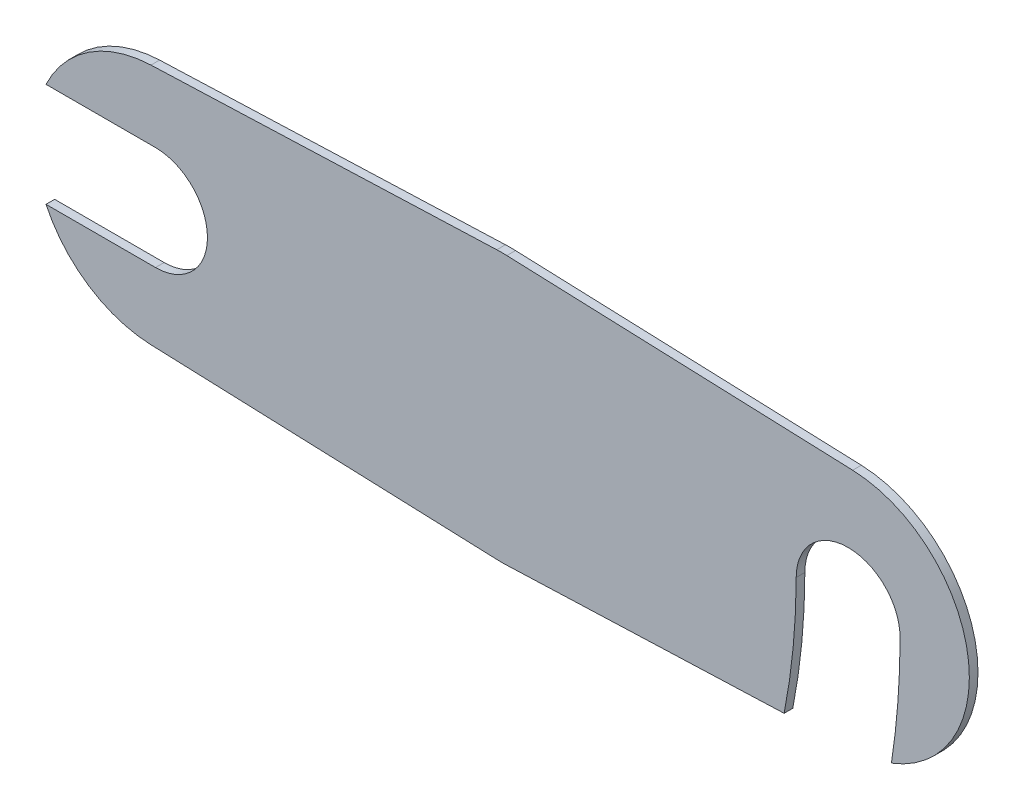
ISO-10303-21;
HEADER;
FILE_DESCRIPTION(('STEP AP214'),'2;1');
FILE_NAME('part.step','',(''),(''),'','','');
FILE_SCHEMA(('AUTOMOTIVE_DESIGN { 1 0 10303 214 1 1 1 1 }'));
ENDSEC;
DATA;
#1=APPLICATION_CONTEXT('core data for automotive mechanical design processes');
#2=APPLICATION_PROTOCOL_DEFINITION('international standard','automotive_design',2000,#1);
#3=PRODUCT_CONTEXT('',#1,'mechanical');
#4=PRODUCT('Part','Part','',(#3));
#5=PRODUCT_RELATED_PRODUCT_CATEGORY('part','',(#4));
#6=PRODUCT_DEFINITION_FORMATION('','',#4);
#7=PRODUCT_DEFINITION_CONTEXT('part definition',#1,'design');
#8=PRODUCT_DEFINITION('design','',#6,#7);
#9=PRODUCT_DEFINITION_SHAPE('','',#8);
#10=(LENGTH_UNIT() NAMED_UNIT(*) SI_UNIT(.MILLI.,.METRE.));
#11=(NAMED_UNIT(*) PLANE_ANGLE_UNIT() SI_UNIT($,.RADIAN.));
#12=(NAMED_UNIT(*) SI_UNIT($,.STERADIAN.) SOLID_ANGLE_UNIT());
#13=UNCERTAINTY_MEASURE_WITH_UNIT(LENGTH_MEASURE(1.E-05),#10,'distance_accuracy_value','');
#14=(GEOMETRIC_REPRESENTATION_CONTEXT(3) GLOBAL_UNCERTAINTY_ASSIGNED_CONTEXT((#13)) GLOBAL_UNIT_ASSIGNED_CONTEXT((#10,
#11,#12)) REPRESENTATION_CONTEXT('',''));
#15=CARTESIAN_POINT('',(0.,0.,0.));
#16=DIRECTION('',(0.,0.,1.));
#17=DIRECTION('',(1.,0.,0.));
#18=AXIS2_PLACEMENT_3D('',#15,#16,#17);
#19=CARTESIAN_POINT('',(0.,0.,-0.5));
#20=DIRECTION('',(0.,0.,-1.));
#21=DIRECTION('',(1.,0.,0.));
#22=AXIS2_PLACEMENT_3D('',#19,#20,#21);
#23=PLANE('',#22);
#24=CARTESIAN_POINT('',(20.,0.,-0.5));
#25=DIRECTION('',(0.,0.,1.));
#26=DIRECTION('',(1.,0.,0.));
#27=AXIS2_PLACEMENT_3D('',#24,#25,#26);
#28=CIRCLE('',#27,3.);
#29=CARTESIAN_POINT('',(23.,0.,-0.5));
#30=VERTEX_POINT('',#29);
#31=CARTESIAN_POINT('',(17.,0.,-0.5));
#32=VERTEX_POINT('',#31);
#33=EDGE_CURVE('E149',#30,#32,#28,.T.);
#34=ORIENTED_EDGE('',*,*,#33,.T.);
#35=CARTESIAN_POINT('',(-20.,0.,-0.5));
#36=DIRECTION('',(0.,0.,1.));
#37=DIRECTION('',(1.,0.,0.));
#38=AXIS2_PLACEMENT_3D('',#35,#36,#37);
#39=CIRCLE('',#38,37.);
#40=CARTESIAN_POINT('',(16.3038364291376,-7.14363076638377,-0.5));
#41=VERTEX_POINT('',#40);
#42=EDGE_CURVE('E163',#32,#41,#39,.F.);
#43=ORIENTED_EDGE('',*,*,#42,.T.);
#44=DIRECTION('',(0.999296627633657,0.0375000000000003,0.));
#45=VECTOR('',#44,1.);
#46=CARTESIAN_POINT('',(0.290625000000002,-7.74454886416084,-0.5));
#47=LINE('',#46,#45);
#48=CARTESIAN_POINT('',(0.290625000000003,-7.74454886416084,-0.5));
#49=VERTEX_POINT('',#48);
#50=EDGE_CURVE('E219',#49,#41,#47,.T.);
#51=ORIENTED_EDGE('',*,*,#50,.F.);
#52=CARTESIAN_POINT('',(0.,0.,-0.5));
#53=DIRECTION('',(0.,0.,1.));
#54=DIRECTION('',(1.,0.,0.));
#55=AXIS2_PLACEMENT_3D('',#52,#53,#54);
#56=CIRCLE('',#55,7.75);
#57=CARTESIAN_POINT('',(-0.290625,-7.74454886416085,-0.5));
#58=VERTEX_POINT('',#57);
#59=EDGE_CURVE('E216',#58,#49,#56,.T.);
#60=ORIENTED_EDGE('',*,*,#59,.F.);
#61=DIRECTION('',(0.999296627633657,-0.0375,0.));
#62=VECTOR('',#61,1.);
#63=CARTESIAN_POINT('',(-0.290625,-7.74454886416085,-0.5));
#64=LINE('',#63,#62);
#65=CARTESIAN_POINT('',(-20.2625,-6.9950763934356,-0.5));
#66=VERTEX_POINT('',#65);
#67=EDGE_CURVE('E213',#66,#58,#64,.T.);
#68=ORIENTED_EDGE('',*,*,#67,.F.);
#69=CARTESIAN_POINT('',(-20.,0.,-0.5));
#70=DIRECTION('',(0.,0.,1.));
#71=DIRECTION('',(1.,0.,0.));
#72=AXIS2_PLACEMENT_3D('',#69,#70,#71);
#73=CIRCLE('',#72,7.);
#74=CARTESIAN_POINT('',(-26.3245553203368,-3.,-0.5));
#75=VERTEX_POINT('',#74);
#76=EDGE_CURVE('E209',#75,#66,#73,.T.);
#77=ORIENTED_EDGE('',*,*,#76,.F.);
#78=DIRECTION('',(1.,0.,0.));
#79=VECTOR('',#78,1.);
#80=CARTESIAN_POINT('',(-20.,-3.,-0.5));
#81=LINE('',#80,#79);
#82=CARTESIAN_POINT('',(-20.,-3.,-0.5));
#83=VERTEX_POINT('',#82);
#84=EDGE_CURVE('E180',#75,#83,#81,.T.);
#85=ORIENTED_EDGE('',*,*,#84,.T.);
#86=CARTESIAN_POINT('',(-20.,0.,-0.5));
#87=DIRECTION('',(0.,0.,1.));
#88=DIRECTION('',(1.,0.,0.));
#89=AXIS2_PLACEMENT_3D('',#86,#87,#88);
#90=CIRCLE('',#89,3.);
#91=CARTESIAN_POINT('',(-20.,3.,-0.5));
#92=VERTEX_POINT('',#91);
#93=EDGE_CURVE('E196',#83,#92,#90,.T.);
#94=ORIENTED_EDGE('',*,*,#93,.T.);
#95=DIRECTION('',(-1.,0.,0.));
#96=VECTOR('',#95,1.);
#97=CARTESIAN_POINT('',(-20.,3.,-0.5));
#98=LINE('',#97,#96);
#99=CARTESIAN_POINT('',(-26.3245553203368,3.,-0.5));
#100=VERTEX_POINT('',#99);
#101=EDGE_CURVE('E172',#92,#100,#98,.T.);
#102=ORIENTED_EDGE('',*,*,#101,.T.);
#103=CARTESIAN_POINT('',(-20.2625,6.9950763934356,-0.5));
#104=VERTEX_POINT('',#103);
#105=EDGE_CURVE('E210',#104,#100,#73,.T.);
#106=ORIENTED_EDGE('',*,*,#105,.F.);
#107=DIRECTION('',(-0.999296627633657,-0.0375,0.));
#108=VECTOR('',#107,1.);
#109=CARTESIAN_POINT('',(-0.290625,7.74454886416085,-0.5));
#110=LINE('',#109,#108);
#111=CARTESIAN_POINT('',(-0.290625,7.74454886416085,-0.5));
#112=VERTEX_POINT('',#111);
#113=EDGE_CURVE('E205',#112,#104,#110,.T.);
#114=ORIENTED_EDGE('',*,*,#113,.F.);
#115=CARTESIAN_POINT('',(0.,0.,-0.5));
#116=DIRECTION('',(0.,0.,1.));
#117=DIRECTION('',(1.,0.,0.));
#118=AXIS2_PLACEMENT_3D('',#115,#116,#117);
#119=CIRCLE('',#118,7.75);
#120=CARTESIAN_POINT('',(0.290624999999998,7.74454886416084,-0.5));
#121=VERTEX_POINT('',#120);
#122=EDGE_CURVE('E202',#121,#112,#119,.T.);
#123=ORIENTED_EDGE('',*,*,#122,.F.);
#124=DIRECTION('',(-0.999296627633657,0.0374999999999998,0.));
#125=VECTOR('',#124,1.);
#126=CARTESIAN_POINT('',(0.290624999999998,7.74454886416084,-0.5));
#127=LINE('',#126,#125);
#128=CARTESIAN_POINT('',(20.2625,6.99507639343561,-0.5));
#129=VERTEX_POINT('',#128);
#130=EDGE_CURVE('E225',#129,#121,#127,.T.);
#131=ORIENTED_EDGE('',*,*,#130,.F.);
#132=CARTESIAN_POINT('',(20.,0.,-0.5));
#133=DIRECTION('',(0.,0.,1.));
#134=DIRECTION('',(1.,0.,0.));
#135=AXIS2_PLACEMENT_3D('',#132,#133,#134);
#136=CIRCLE('',#135,7.);
#137=CARTESIAN_POINT('',(22.5,-6.53834841531101,-0.5));
#138=VERTEX_POINT('',#137);
#139=EDGE_CURVE('E222',#138,#129,#136,.T.);
#140=ORIENTED_EDGE('',*,*,#139,.F.);
#141=CARTESIAN_POINT('',(-20.,0.,-0.5));
#142=DIRECTION('',(0.,0.,1.));
#143=DIRECTION('',(1.,0.,0.));
#144=AXIS2_PLACEMENT_3D('',#141,#142,#143);
#145=CIRCLE('',#144,43.);
#146=EDGE_CURVE('E167',#30,#138,#145,.F.);
#147=ORIENTED_EDGE('',*,*,#146,.F.);
#148=EDGE_LOOP('',(#34,#43,#51,#60,#68,#77,#85,#94,#102,#106,#114,#123,#131,#140,#147));
#149=FACE_BOUND('',#148,.T.);
#150=ADVANCED_FACE('F37',(#149),#23,.T.);
#151=CARTESIAN_POINT('',(0.,0.,0.));
#152=DIRECTION('',(0.,0.,-1.));
#153=DIRECTION('',(1.,0.,0.));
#154=AXIS2_PLACEMENT_3D('',#151,#152,#153);
#155=PLANE('',#154);
#156=CARTESIAN_POINT('',(-20.,0.,0.));
#157=DIRECTION('',(0.,0.,1.));
#158=DIRECTION('',(1.,0.,0.));
#159=AXIS2_PLACEMENT_3D('',#156,#157,#158);
#160=CIRCLE('',#159,43.);
#161=CARTESIAN_POINT('',(23.,0.,0.));
#162=VERTEX_POINT('',#161);
#163=CARTESIAN_POINT('',(22.5,-6.53834841531101,0.));
#164=VERTEX_POINT('',#163);
#165=EDGE_CURVE('E156',#162,#164,#160,.F.);
#166=ORIENTED_EDGE('',*,*,#165,.T.);
#167=CARTESIAN_POINT('',(20.,0.,0.));
#168=DIRECTION('',(0.,0.,1.));
#169=DIRECTION('',(1.,0.,0.));
#170=AXIS2_PLACEMENT_3D('',#167,#168,#169);
#171=CIRCLE('',#170,7.);
#172=CARTESIAN_POINT('',(20.2625,6.99507639343561,0.));
#173=VERTEX_POINT('',#172);
#174=EDGE_CURVE('E246',#164,#173,#171,.T.);
#175=ORIENTED_EDGE('',*,*,#174,.T.);
#176=DIRECTION('',(-0.999296627633657,0.0374999999999998,0.));
#177=VECTOR('',#176,1.);
#178=CARTESIAN_POINT('',(0.290624999999998,7.74454886416084,0.));
#179=LINE('',#178,#177);
#180=CARTESIAN_POINT('',(0.290624999999998,7.74454886416084,0.));
#181=VERTEX_POINT('',#180);
#182=EDGE_CURVE('E206',#173,#181,#179,.T.);
#183=ORIENTED_EDGE('',*,*,#182,.T.);
#184=CARTESIAN_POINT('',(0.,0.,0.));
#185=DIRECTION('',(0.,0.,1.));
#186=DIRECTION('',(1.,0.,0.));
#187=AXIS2_PLACEMENT_3D('',#184,#185,#186);
#188=CIRCLE('',#187,7.75);
#189=CARTESIAN_POINT('',(-0.290625,7.74454886416085,0.));
#190=VERTEX_POINT('',#189);
#191=EDGE_CURVE('E199',#181,#190,#188,.T.);
#192=ORIENTED_EDGE('',*,*,#191,.T.);
#193=DIRECTION('',(-0.999296627633657,-0.0375,0.));
#194=VECTOR('',#193,1.);
#195=CARTESIAN_POINT('',(-0.290625,7.74454886416085,0.));
#196=LINE('',#195,#194);
#197=CARTESIAN_POINT('',(-20.2625,6.9950763934356,0.));
#198=VERTEX_POINT('',#197);
#199=EDGE_CURVE('E231',#190,#198,#196,.T.);
#200=ORIENTED_EDGE('',*,*,#199,.T.);
#201=CARTESIAN_POINT('',(-20.,0.,0.));
#202=DIRECTION('',(0.,0.,1.));
#203=DIRECTION('',(1.,0.,0.));
#204=AXIS2_PLACEMENT_3D('',#201,#202,#203);
#205=CIRCLE('',#204,7.);
#206=CARTESIAN_POINT('',(-26.3245553203368,3.,0.));
#207=VERTEX_POINT('',#206);
#208=EDGE_CURVE('E235',#198,#207,#205,.T.);
#209=ORIENTED_EDGE('',*,*,#208,.T.);
#210=DIRECTION('',(-1.,0.,0.));
#211=VECTOR('',#210,1.);
#212=CARTESIAN_POINT('',(-20.,3.,0.));
#213=LINE('',#212,#211);
#214=CARTESIAN_POINT('',(-20.,3.,0.));
#215=VERTEX_POINT('',#214);
#216=EDGE_CURVE('E176',#215,#207,#213,.T.);
#217=ORIENTED_EDGE('',*,*,#216,.F.);
#218=CARTESIAN_POINT('',(-20.,0.,0.));
#219=DIRECTION('',(0.,0.,1.));
#220=DIRECTION('',(1.,0.,0.));
#221=AXIS2_PLACEMENT_3D('',#218,#219,#220);
#222=CIRCLE('',#221,3.);
#223=CARTESIAN_POINT('',(-20.,-3.,0.));
#224=VERTEX_POINT('',#223);
#225=EDGE_CURVE('E194',#224,#215,#222,.T.);
#226=ORIENTED_EDGE('',*,*,#225,.F.);
#227=DIRECTION('',(1.,0.,0.));
#228=VECTOR('',#227,1.);
#229=CARTESIAN_POINT('',(-20.,-3.,0.));
#230=LINE('',#229,#228);
#231=CARTESIAN_POINT('',(-26.3245553203368,-3.,0.));
#232=VERTEX_POINT('',#231);
#233=EDGE_CURVE('E179',#232,#224,#230,.T.);
#234=ORIENTED_EDGE('',*,*,#233,.F.);
#235=CARTESIAN_POINT('',(-20.2625,-6.9950763934356,0.));
#236=VERTEX_POINT('',#235);
#237=EDGE_CURVE('E234',#232,#236,#205,.T.);
#238=ORIENTED_EDGE('',*,*,#237,.T.);
#239=DIRECTION('',(0.999296627633657,-0.0375,0.));
#240=VECTOR('',#239,1.);
#241=CARTESIAN_POINT('',(-0.290625,-7.74454886416085,0.));
#242=LINE('',#241,#240);
#243=CARTESIAN_POINT('',(-0.290625,-7.74454886416085,0.));
#244=VERTEX_POINT('',#243);
#245=EDGE_CURVE('E238',#236,#244,#242,.T.);
#246=ORIENTED_EDGE('',*,*,#245,.T.);
#247=CARTESIAN_POINT('',(0.,0.,0.));
#248=DIRECTION('',(0.,0.,1.));
#249=DIRECTION('',(1.,0.,0.));
#250=AXIS2_PLACEMENT_3D('',#247,#248,#249);
#251=CIRCLE('',#250,7.75);
#252=CARTESIAN_POINT('',(0.290625000000003,-7.74454886416084,0.));
#253=VERTEX_POINT('',#252);
#254=EDGE_CURVE('E241',#244,#253,#251,.T.);
#255=ORIENTED_EDGE('',*,*,#254,.T.);
#256=DIRECTION('',(0.999296627633657,0.0375000000000003,0.));
#257=VECTOR('',#256,1.);
#258=CARTESIAN_POINT('',(0.290625000000002,-7.74454886416084,0.));
#259=LINE('',#258,#257);
#260=CARTESIAN_POINT('',(16.3038364291376,-7.14363076638377,0.));
#261=VERTEX_POINT('',#260);
#262=EDGE_CURVE('E244',#253,#261,#259,.T.);
#263=ORIENTED_EDGE('',*,*,#262,.T.);
#264=CARTESIAN_POINT('',(-20.,0.,0.));
#265=DIRECTION('',(0.,0.,1.));
#266=DIRECTION('',(1.,0.,0.));
#267=AXIS2_PLACEMENT_3D('',#264,#265,#266);
#268=CIRCLE('',#267,37.);
#269=CARTESIAN_POINT('',(17.,0.,0.));
#270=VERTEX_POINT('',#269);
#271=EDGE_CURVE('E150',#270,#261,#268,.F.);
#272=ORIENTED_EDGE('',*,*,#271,.F.);
#273=CARTESIAN_POINT('',(20.,0.,0.));
#274=DIRECTION('',(0.,0.,1.));
#275=DIRECTION('',(1.,0.,0.));
#276=AXIS2_PLACEMENT_3D('',#273,#274,#275);
#277=CIRCLE('',#276,3.);
#278=EDGE_CURVE('E146',#162,#270,#277,.T.);
#279=ORIENTED_EDGE('',*,*,#278,.F.);
#280=EDGE_LOOP('',(#166,#175,#183,#192,#200,#209,#217,#226,#234,#238,#246,#255,#263,#272,#279));
#281=FACE_BOUND('',#280,.T.);
#282=ADVANCED_FACE('F154',(#281),#155,.F.);
#283=CARTESIAN_POINT('',(20.,0.,-0.5));
#284=DIRECTION('',(0.,0.,1.));
#285=DIRECTION('',(-1.,0.,0.));
#286=AXIS2_PLACEMENT_3D('',#283,#284,#285);
#287=CYLINDRICAL_SURFACE('',#286,7.);
#288=DIRECTION('',(0.,0.,-1.));
#289=VECTOR('',#288,1.);
#290=CARTESIAN_POINT('',(22.5,-6.53834841531101,0.));
#291=LINE('',#290,#289);
#292=EDGE_CURVE('E161',#164,#138,#291,.T.);
#293=ORIENTED_EDGE('',*,*,#292,.T.);
#294=ORIENTED_EDGE('',*,*,#139,.T.);
#295=DIRECTION('',(0.,0.,1.));
#296=VECTOR('',#295,1.);
#297=CARTESIAN_POINT('',(20.2625,6.99507639343561,-0.5));
#298=LINE('',#297,#296);
#299=EDGE_CURVE('E251',#129,#173,#298,.T.);
#300=ORIENTED_EDGE('',*,*,#299,.T.);
#301=ORIENTED_EDGE('',*,*,#174,.F.);
#302=EDGE_LOOP('',(#293,#294,#300,#301));
#303=FACE_BOUND('',#302,.T.);
#304=ADVANCED_FACE('F316',(#303),#287,.T.);
#305=CARTESIAN_POINT('',(20.,0.,-0.5));
#306=DIRECTION('',(0.,0.,1.));
#307=DIRECTION('',(-1.,0.,0.));
#308=AXIS2_PLACEMENT_3D('',#305,#306,#307);
#309=CYLINDRICAL_SURFACE('',#308,3.);
#310=ORIENTED_EDGE('',*,*,#278,.T.);
#311=DIRECTION('',(0.,0.,-1.));
#312=VECTOR('',#311,1.);
#313=CARTESIAN_POINT('',(17.,0.,0.));
#314=LINE('',#313,#312);
#315=EDGE_CURVE('E52',#270,#32,#314,.T.);
#316=ORIENTED_EDGE('',*,*,#315,.T.);
#317=ORIENTED_EDGE('',*,*,#33,.F.);
#318=DIRECTION('',(0.,0.,-1.));
#319=VECTOR('',#318,1.);
#320=CARTESIAN_POINT('',(23.,0.,0.));
#321=LINE('',#320,#319);
#322=EDGE_CURVE('E60',#162,#30,#321,.T.);
#323=ORIENTED_EDGE('',*,*,#322,.F.);
#324=EDGE_LOOP('',(#310,#316,#317,#323));
#325=FACE_BOUND('',#324,.T.);
#326=ADVANCED_FACE('F145',(#325),#309,.F.);
#327=CARTESIAN_POINT('',(-20.,0.,-0.5));
#328=DIRECTION('',(0.,0.,1.));
#329=DIRECTION('',(-1.,0.,0.));
#330=AXIS2_PLACEMENT_3D('',#327,#328,#329);
#331=CYLINDRICAL_SURFACE('',#330,7.);
#332=ORIENTED_EDGE('',*,*,#76,.T.);
#333=DIRECTION('',(0.,0.,1.));
#334=VECTOR('',#333,1.);
#335=CARTESIAN_POINT('',(-20.2625,-6.9950763934356,-0.5));
#336=LINE('',#335,#334);
#337=EDGE_CURVE('E257',#66,#236,#336,.T.);
#338=ORIENTED_EDGE('',*,*,#337,.T.);
#339=ORIENTED_EDGE('',*,*,#237,.F.);
#340=DIRECTION('',(0.,0.,-1.));
#341=VECTOR('',#340,1.);
#342=CARTESIAN_POINT('',(-26.3245553203368,-3.,0.));
#343=LINE('',#342,#341);
#344=EDGE_CURVE('E189',#232,#75,#343,.T.);
#345=ORIENTED_EDGE('',*,*,#344,.T.);
#346=EDGE_LOOP('',(#332,#338,#339,#345));
#347=FACE_BOUND('',#346,.T.);
#348=ADVANCED_FACE('F289',(#347),#331,.T.);
#349=CARTESIAN_POINT('',(0.,0.,-0.5));
#350=DIRECTION('',(0.,0.,1.));
#351=DIRECTION('',(-1.,0.,0.));
#352=AXIS2_PLACEMENT_3D('',#349,#350,#351);
#353=CYLINDRICAL_SURFACE('',#352,7.75);
#354=ORIENTED_EDGE('',*,*,#191,.F.);
#355=DIRECTION('',(0.,0.,1.));
#356=VECTOR('',#355,1.);
#357=CARTESIAN_POINT('',(0.290624999999998,7.74454886416084,-0.5));
#358=LINE('',#357,#356);
#359=EDGE_CURVE('E228',#121,#181,#358,.T.);
#360=ORIENTED_EDGE('',*,*,#359,.F.);
#361=ORIENTED_EDGE('',*,*,#122,.T.);
#362=DIRECTION('',(0.,0.,1.));
#363=VECTOR('',#362,1.);
#364=CARTESIAN_POINT('',(-0.290625,7.74454886416085,-0.5));
#365=LINE('',#364,#363);
#366=EDGE_CURVE('E11',#112,#190,#365,.T.);
#367=ORIENTED_EDGE('',*,*,#366,.T.);
#368=EDGE_LOOP('',(#354,#360,#361,#367));
#369=FACE_BOUND('',#368,.T.);
#370=ADVANCED_FACE('F39',(#369),#353,.T.);
#371=CARTESIAN_POINT('',(-0.290625,7.74454886416085,-0.5));
#372=DIRECTION('',(0.0375,-0.999296627633657,0.));
#373=DIRECTION('',(0.999296627633657,0.0375,0.));
#374=AXIS2_PLACEMENT_3D('',#371,#372,#373);
#375=PLANE('',#374);
#376=ORIENTED_EDGE('',*,*,#199,.F.);
#377=ORIENTED_EDGE('',*,*,#366,.F.);
#378=ORIENTED_EDGE('',*,*,#113,.T.);
#379=DIRECTION('',(0.,0.,1.));
#380=VECTOR('',#379,1.);
#381=CARTESIAN_POINT('',(-20.2625,6.9950763934356,-0.5));
#382=LINE('',#381,#380);
#383=EDGE_CURVE('E45',#104,#198,#382,.T.);
#384=ORIENTED_EDGE('',*,*,#383,.T.);
#385=EDGE_LOOP('',(#376,#377,#378,#384));
#386=FACE_BOUND('',#385,.T.);
#387=ADVANCED_FACE('F261',(#386),#375,.F.);
#388=ORIENTED_EDGE('',*,*,#208,.F.);
#389=ORIENTED_EDGE('',*,*,#383,.F.);
#390=ORIENTED_EDGE('',*,*,#105,.T.);
#391=DIRECTION('',(0.,0.,-1.));
#392=VECTOR('',#391,1.);
#393=CARTESIAN_POINT('',(-26.3245553203368,3.,0.));
#394=LINE('',#393,#392);
#395=EDGE_CURVE('E191',#207,#100,#394,.T.);
#396=ORIENTED_EDGE('',*,*,#395,.F.);
#397=EDGE_LOOP('',(#388,#389,#390,#396));
#398=FACE_BOUND('',#397,.T.);
#399=ADVANCED_FACE('F265',(#398),#331,.T.);
#400=CARTESIAN_POINT('',(-0.290625,-7.74454886416085,-0.5));
#401=DIRECTION('',(0.0375,0.999296627633657,0.));
#402=DIRECTION('',(-0.999296627633657,0.0375,0.));
#403=AXIS2_PLACEMENT_3D('',#400,#401,#402);
#404=PLANE('',#403);
#405=ORIENTED_EDGE('',*,*,#245,.F.);
#406=ORIENTED_EDGE('',*,*,#337,.F.);
#407=ORIENTED_EDGE('',*,*,#67,.T.);
#408=DIRECTION('',(0.,0.,1.));
#409=VECTOR('',#408,1.);
#410=CARTESIAN_POINT('',(-0.290625,-7.74454886416085,-0.5));
#411=LINE('',#410,#409);
#412=EDGE_CURVE('E255',#58,#244,#411,.T.);
#413=ORIENTED_EDGE('',*,*,#412,.T.);
#414=EDGE_LOOP('',(#405,#406,#407,#413));
#415=FACE_BOUND('',#414,.T.);
#416=ADVANCED_FACE('F293',(#415),#404,.F.);
#417=CARTESIAN_POINT('',(0.,0.,-0.5));
#418=DIRECTION('',(0.,0.,1.));
#419=DIRECTION('',(-1.,0.,0.));
#420=AXIS2_PLACEMENT_3D('',#417,#418,#419);
#421=CYLINDRICAL_SURFACE('',#420,7.75);
#422=ORIENTED_EDGE('',*,*,#254,.F.);
#423=ORIENTED_EDGE('',*,*,#412,.F.);
#424=ORIENTED_EDGE('',*,*,#59,.T.);
#425=DIRECTION('',(0.,0.,1.));
#426=VECTOR('',#425,1.);
#427=CARTESIAN_POINT('',(0.290625000000003,-7.74454886416084,-0.5));
#428=LINE('',#427,#426);
#429=EDGE_CURVE('E253',#49,#253,#428,.T.);
#430=ORIENTED_EDGE('',*,*,#429,.T.);
#431=EDGE_LOOP('',(#422,#423,#424,#430));
#432=FACE_BOUND('',#431,.T.);
#433=ADVANCED_FACE('F297',(#432),#421,.T.);
#434=CARTESIAN_POINT('',(0.290625000000002,-7.74454886416084,-0.5));
#435=DIRECTION('',(-0.0375000000000003,0.999296627633657,0.));
#436=DIRECTION('',(-0.999296627633657,-0.0375000000000003,0.));
#437=AXIS2_PLACEMENT_3D('',#434,#435,#436);
#438=PLANE('',#437);
#439=ORIENTED_EDGE('',*,*,#262,.F.);
#440=ORIENTED_EDGE('',*,*,#429,.F.);
#441=ORIENTED_EDGE('',*,*,#50,.T.);
#442=DIRECTION('',(0.,0.,-1.));
#443=VECTOR('',#442,1.);
#444=CARTESIAN_POINT('',(16.3038364291376,-7.14363076638377,0.));
#445=LINE('',#444,#443);
#446=EDGE_CURVE('E173',#261,#41,#445,.T.);
#447=ORIENTED_EDGE('',*,*,#446,.F.);
#448=EDGE_LOOP('',(#439,#440,#441,#447));
#449=FACE_BOUND('',#448,.T.);
#450=ADVANCED_FACE('F301',(#449),#438,.F.);
#451=CARTESIAN_POINT('',(0.290624999999998,7.74454886416084,-0.5));
#452=DIRECTION('',(-0.0374999999999998,-0.999296627633657,0.));
#453=DIRECTION('',(0.999296627633657,-0.0374999999999998,0.));
#454=AXIS2_PLACEMENT_3D('',#451,#452,#453);
#455=PLANE('',#454);
#456=ORIENTED_EDGE('',*,*,#182,.F.);
#457=ORIENTED_EDGE('',*,*,#299,.F.);
#458=ORIENTED_EDGE('',*,*,#130,.T.);
#459=ORIENTED_EDGE('',*,*,#359,.T.);
#460=EDGE_LOOP('',(#456,#457,#458,#459));
#461=FACE_BOUND('',#460,.T.);
#462=ADVANCED_FACE('F321',(#461),#455,.F.);
#463=CARTESIAN_POINT('',(-20.,0.,-0.5));
#464=DIRECTION('',(0.,0.,1.));
#465=DIRECTION('',(-1.,0.,0.));
#466=AXIS2_PLACEMENT_3D('',#463,#464,#465);
#467=CYLINDRICAL_SURFACE('',#466,3.);
#468=DIRECTION('',(0.,0.,-1.));
#469=VECTOR('',#468,1.);
#470=CARTESIAN_POINT('',(-20.,-3.,0.));
#471=LINE('',#470,#469);
#472=EDGE_CURVE('E158',#224,#83,#471,.T.);
#473=ORIENTED_EDGE('',*,*,#472,.F.);
#474=ORIENTED_EDGE('',*,*,#225,.T.);
#475=DIRECTION('',(0.,0.,-1.));
#476=VECTOR('',#475,1.);
#477=CARTESIAN_POINT('',(-20.,3.,0.));
#478=LINE('',#477,#476);
#479=EDGE_CURVE('E183',#215,#92,#478,.T.);
#480=ORIENTED_EDGE('',*,*,#479,.T.);
#481=ORIENTED_EDGE('',*,*,#93,.F.);
#482=EDGE_LOOP('',(#473,#474,#480,#481));
#483=FACE_BOUND('',#482,.T.);
#484=ADVANCED_FACE('F281',(#483),#467,.F.);
#485=CARTESIAN_POINT('',(-20.,3.,0.));
#486=DIRECTION('',(0.,1.,0.));
#487=DIRECTION('',(-1.,0.,0.));
#488=AXIS2_PLACEMENT_3D('',#485,#486,#487);
#489=PLANE('',#488);
#490=ORIENTED_EDGE('',*,*,#101,.F.);
#491=ORIENTED_EDGE('',*,*,#479,.F.);
#492=ORIENTED_EDGE('',*,*,#216,.T.);
#493=ORIENTED_EDGE('',*,*,#395,.T.);
#494=EDGE_LOOP('',(#490,#491,#492,#493));
#495=FACE_BOUND('',#494,.T.);
#496=ADVANCED_FACE('F276',(#495),#489,.F.);
#497=CARTESIAN_POINT('',(-20.,-3.,0.));
#498=DIRECTION('',(0.,-1.,0.));
#499=DIRECTION('',(0.,0.,1.));
#500=AXIS2_PLACEMENT_3D('',#497,#498,#499);
#501=PLANE('',#500);
#502=ORIENTED_EDGE('',*,*,#84,.F.);
#503=ORIENTED_EDGE('',*,*,#344,.F.);
#504=ORIENTED_EDGE('',*,*,#233,.T.);
#505=ORIENTED_EDGE('',*,*,#472,.T.);
#506=EDGE_LOOP('',(#502,#503,#504,#505));
#507=FACE_BOUND('',#506,.T.);
#508=ADVANCED_FACE('F284',(#507),#501,.F.);
#509=CARTESIAN_POINT('',(-20.,0.,0.));
#510=DIRECTION('',(0.,0.,-1.));
#511=DIRECTION('',(1.,0.,0.));
#512=AXIS2_PLACEMENT_3D('',#509,#510,#511);
#513=CYLINDRICAL_SURFACE('',#512,37.);
#514=ORIENTED_EDGE('',*,*,#42,.F.);
#515=ORIENTED_EDGE('',*,*,#315,.F.);
#516=ORIENTED_EDGE('',*,*,#271,.T.);
#517=ORIENTED_EDGE('',*,*,#446,.T.);
#518=EDGE_LOOP('',(#514,#515,#516,#517));
#519=FACE_BOUND('',#518,.T.);
#520=ADVANCED_FACE('F302',(#519),#513,.T.);
#521=CARTESIAN_POINT('',(-20.,0.,0.));
#522=DIRECTION('',(0.,0.,-1.));
#523=DIRECTION('',(1.,0.,0.));
#524=AXIS2_PLACEMENT_3D('',#521,#522,#523);
#525=CYLINDRICAL_SURFACE('',#524,43.);
#526=ORIENTED_EDGE('',*,*,#146,.T.);
#527=ORIENTED_EDGE('',*,*,#292,.F.);
#528=ORIENTED_EDGE('',*,*,#165,.F.);
#529=ORIENTED_EDGE('',*,*,#322,.T.);
#530=EDGE_LOOP('',(#526,#527,#528,#529));
#531=FACE_BOUND('',#530,.T.);
#532=ADVANCED_FACE('F160',(#531),#525,.F.);
#533=CLOSED_SHELL('',(#150,#282,#304,#326,#348,#370,#387,#399,#416,#433,#450,#462,#484,#496,
#508,#520,#532));
#534=MANIFOLD_SOLID_BREP('B2',#533);
#535=ADVANCED_BREP_SHAPE_REPRESENTATION('',(#18,#534),#14);
#536=SHAPE_DEFINITION_REPRESENTATION(#9,#535);
ENDSEC;
END-ISO-10303-21;
